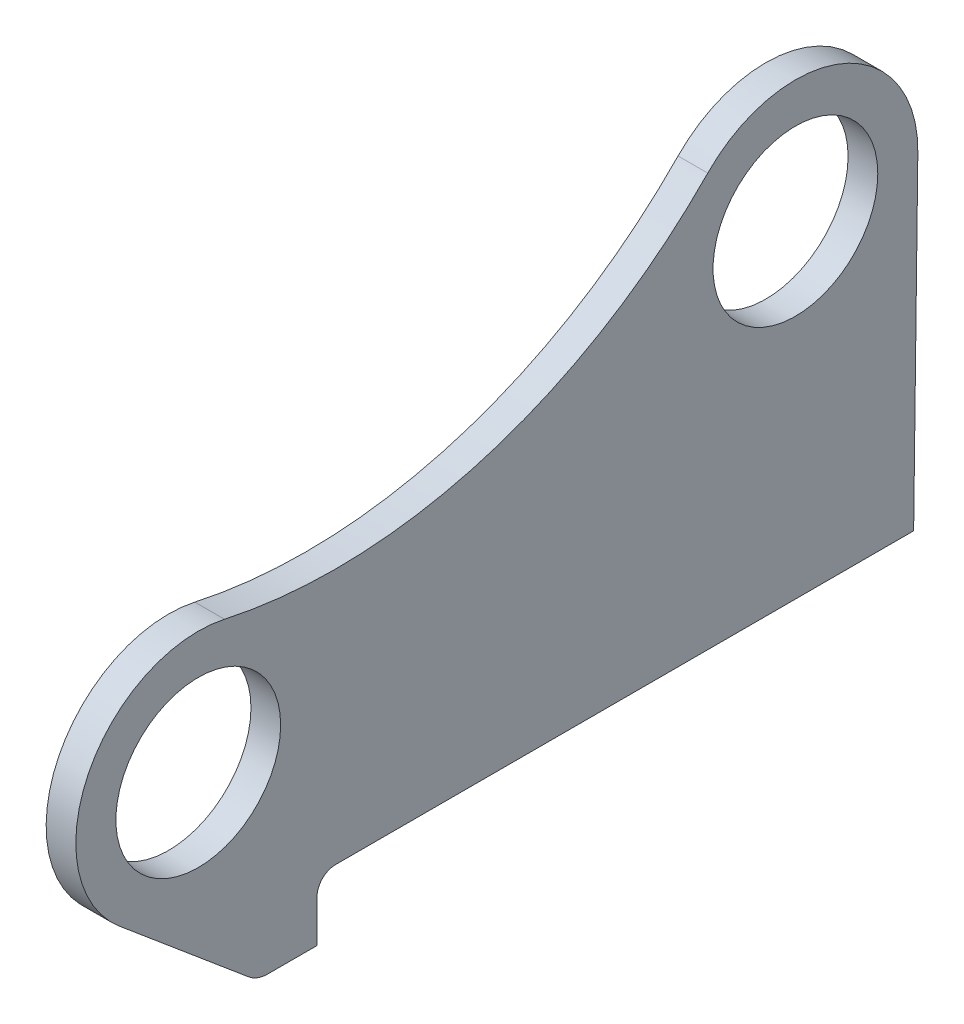
ISO-10303-21;
HEADER;
FILE_DESCRIPTION(('STEP AP214'),'2;1');
FILE_NAME('part.step','',(''),(''),'','','');
FILE_SCHEMA(('AUTOMOTIVE_DESIGN { 1 0 10303 214 1 1 1 1 }'));
ENDSEC;
DATA;
#1=APPLICATION_CONTEXT('core data for automotive mechanical design processes');
#2=APPLICATION_PROTOCOL_DEFINITION('international standard','automotive_design',2000,#1);
#3=PRODUCT_CONTEXT('',#1,'mechanical');
#4=PRODUCT('Part','Part','',(#3));
#5=PRODUCT_RELATED_PRODUCT_CATEGORY('part','',(#4));
#6=PRODUCT_DEFINITION_FORMATION('','',#4);
#7=PRODUCT_DEFINITION_CONTEXT('part definition',#1,'design');
#8=PRODUCT_DEFINITION('design','',#6,#7);
#9=PRODUCT_DEFINITION_SHAPE('','',#8);
#10=(LENGTH_UNIT() NAMED_UNIT(*) SI_UNIT(.MILLI.,.METRE.));
#11=(NAMED_UNIT(*) PLANE_ANGLE_UNIT() SI_UNIT($,.RADIAN.));
#12=(NAMED_UNIT(*) SI_UNIT($,.STERADIAN.) SOLID_ANGLE_UNIT());
#13=UNCERTAINTY_MEASURE_WITH_UNIT(LENGTH_MEASURE(1.E-05),#10,'distance_accuracy_value','');
#14=(GEOMETRIC_REPRESENTATION_CONTEXT(3) GLOBAL_UNCERTAINTY_ASSIGNED_CONTEXT((#13)) GLOBAL_UNIT_ASSIGNED_CONTEXT((#10,
#11,#12)) REPRESENTATION_CONTEXT('',''));
#15=CARTESIAN_POINT('',(0.,0.,0.));
#16=DIRECTION('',(0.,0.,1.));
#17=DIRECTION('',(1.,0.,0.));
#18=AXIS2_PLACEMENT_3D('',#15,#16,#17);
#19=CARTESIAN_POINT('',(-20.,522.453686390013,-12.6775747173587));
#20=DIRECTION('',(1.,0.,0.));
#21=DIRECTION('',(0.,0.,-1.));
#22=AXIS2_PLACEMENT_3D('',#19,#20,#21);
#23=CYLINDRICAL_SURFACE('',#22,350.);
#24=CARTESIAN_POINT('',(0.,522.453686390013,-12.6775747173587));
#25=DIRECTION('',(-1.,0.,0.));
#26=DIRECTION('',(0.,0.,-1.));
#27=AXIS2_PLACEMENT_3D('',#24,#25,#26);
#28=CIRCLE('',#27,350.);
#29=CARTESIAN_POINT('',(0.,278.110759488816,-263.269941068284));
#30=VERTEX_POINT('',#29);
#31=CARTESIAN_POINT('',(0.,180.583651161104,62.3216186955327));
#32=VERTEX_POINT('',#31);
#33=EDGE_CURVE('E152',#30,#32,#28,.T.);
#34=ORIENTED_EDGE('',*,*,#33,.F.);
#35=DIRECTION('',(1.,0.,0.));
#36=VECTOR('',#35,1.);
#37=CARTESIAN_POINT('',(-20.,278.110759488816,-263.269941068284));
#38=LINE('',#37,#36);
#39=CARTESIAN_POINT('',(-20.,278.110759488816,-263.269941068284));
#40=VERTEX_POINT('',#39);
#41=EDGE_CURVE('E11',#40,#30,#38,.T.);
#42=ORIENTED_EDGE('',*,*,#41,.F.);
#43=CARTESIAN_POINT('',(-20.,522.453686390013,-12.6775747173587));
#44=DIRECTION('',(-1.,0.,0.));
#45=DIRECTION('',(0.,0.,-1.));
#46=AXIS2_PLACEMENT_3D('',#43,#44,#45);
#47=CIRCLE('',#46,350.);
#48=CARTESIAN_POINT('',(-20.,180.583651161104,62.3216186955327));
#49=VERTEX_POINT('',#48);
#50=EDGE_CURVE('E179',#40,#49,#47,.T.);
#51=ORIENTED_EDGE('',*,*,#50,.T.);
#52=DIRECTION('',(1.,0.,0.));
#53=VECTOR('',#52,1.);
#54=CARTESIAN_POINT('',(-20.,180.583651161104,62.3216186955327));
#55=LINE('',#54,#53);
#56=EDGE_CURVE('E46',#49,#32,#55,.T.);
#57=ORIENTED_EDGE('',*,*,#56,.T.);
#58=EDGE_LOOP('',(#34,#42,#51,#57));
#59=FACE_BOUND('',#58,.T.);
#60=ADVANCED_FACE('F43',(#59),#23,.F.);
#61=CARTESIAN_POINT('',(-20.,220.515641004963,-322.338141708145));
#62=DIRECTION('',(1.,0.,0.));
#63=DIRECTION('',(0.,0.,-1.));
#64=AXIS2_PLACEMENT_3D('',#61,#62,#63);
#65=CYLINDRICAL_SURFACE('',#64,82.5000000000001);
#66=CARTESIAN_POINT('',(0.,220.515641004963,-322.338141708145));
#67=DIRECTION('',(1.,0.,0.));
#68=DIRECTION('',(0.,0.,-1.));
#69=AXIS2_PLACEMENT_3D('',#66,#67,#68);
#70=CIRCLE('',#69,82.5000000000001);
#71=CARTESIAN_POINT('',(0.,219.451346471347,-404.831276435501));
#72=VERTEX_POINT('',#71);
#73=EDGE_CURVE('E177',#72,#30,#70,.T.);
#74=ORIENTED_EDGE('',*,*,#73,.F.);
#75=DIRECTION('',(1.,0.,0.));
#76=VECTOR('',#75,1.);
#77=CARTESIAN_POINT('',(-20.,219.451346471347,-404.831276435501));
#78=LINE('',#77,#76);
#79=CARTESIAN_POINT('',(-20.,219.451346471347,-404.831276435501));
#80=VERTEX_POINT('',#79);
#81=EDGE_CURVE('E52',#80,#72,#78,.T.);
#82=ORIENTED_EDGE('',*,*,#81,.F.);
#83=CARTESIAN_POINT('',(-20.,220.515641004963,-322.338141708145));
#84=DIRECTION('',(1.,0.,0.));
#85=DIRECTION('',(0.,0.,-1.));
#86=AXIS2_PLACEMENT_3D('',#83,#84,#85);
#87=CIRCLE('',#86,82.5000000000001);
#88=EDGE_CURVE('E142',#80,#40,#87,.T.);
#89=ORIENTED_EDGE('',*,*,#88,.T.);
#90=ORIENTED_EDGE('',*,*,#41,.T.);
#91=EDGE_LOOP('',(#74,#82,#89,#90));
#92=FACE_BOUND('',#91,.T.);
#93=ADVANCED_FACE('F195',(#92),#65,.T.);
#94=CARTESIAN_POINT('',(-20.,0.,-402.));
#95=DIRECTION('',(0.,-0.0129005398014108,-0.999916784574013));
#96=DIRECTION('',(0.,0.999916784574013,-0.0129005398014108));
#97=AXIS2_PLACEMENT_3D('',#94,#95,#96);
#98=PLANE('',#97);
#99=DIRECTION('',(0.,0.999916784574012,-0.0129005398014108));
#100=VECTOR('',#99,1.);
#101=CARTESIAN_POINT('',(0.,0.,-402.));
#102=LINE('',#101,#100);
#103=CARTESIAN_POINT('',(0.,0.,-402.));
#104=VERTEX_POINT('',#103);
#105=EDGE_CURVE('E129',#104,#72,#102,.T.);
#106=ORIENTED_EDGE('',*,*,#105,.F.);
#107=DIRECTION('',(1.,0.,0.));
#108=VECTOR('',#107,1.);
#109=CARTESIAN_POINT('',(-20.,0.,-402.));
#110=LINE('',#109,#108);
#111=CARTESIAN_POINT('',(-20.,0.,-402.));
#112=VERTEX_POINT('',#111);
#113=EDGE_CURVE('E124',#112,#104,#110,.T.);
#114=ORIENTED_EDGE('',*,*,#113,.F.);
#115=DIRECTION('',(0.,0.999916784574012,-0.0129005398014108));
#116=VECTOR('',#115,1.);
#117=CARTESIAN_POINT('',(-20.,0.,-402.));
#118=LINE('',#117,#116);
#119=EDGE_CURVE('E127',#112,#80,#118,.T.);
#120=ORIENTED_EDGE('',*,*,#119,.T.);
#121=ORIENTED_EDGE('',*,*,#81,.T.);
#122=EDGE_LOOP('',(#106,#114,#120,#121));
#123=FACE_BOUND('',#122,.T.);
#124=ADVANCED_FACE('F126',(#123),#98,.T.);
#125=CARTESIAN_POINT('',(-20.,0.,-12.5));
#126=DIRECTION('',(0.,-1.,0.));
#127=DIRECTION('',(0.,0.,-1.));
#128=AXIS2_PLACEMENT_3D('',#125,#126,#127);
#129=PLANE('',#128);
#130=DIRECTION('',(0.,0.,-1.));
#131=VECTOR('',#130,1.);
#132=CARTESIAN_POINT('',(0.,0.,-12.5));
#133=LINE('',#132,#131);
#134=CARTESIAN_POINT('',(0.,0.,-12.5));
#135=VERTEX_POINT('',#134);
#136=EDGE_CURVE('E174',#135,#104,#133,.T.);
#137=ORIENTED_EDGE('',*,*,#136,.F.);
#138=DIRECTION('',(1.,0.,0.));
#139=VECTOR('',#138,1.);
#140=CARTESIAN_POINT('',(-20.,0.,-12.5));
#141=LINE('',#140,#139);
#142=CARTESIAN_POINT('',(-20.,0.,-12.5));
#143=VERTEX_POINT('',#142);
#144=EDGE_CURVE('E134',#143,#135,#141,.T.);
#145=ORIENTED_EDGE('',*,*,#144,.F.);
#146=DIRECTION('',(0.,0.,-1.));
#147=VECTOR('',#146,1.);
#148=CARTESIAN_POINT('',(-20.,0.,-12.5));
#149=LINE('',#148,#147);
#150=EDGE_CURVE('E140',#143,#112,#149,.T.);
#151=ORIENTED_EDGE('',*,*,#150,.T.);
#152=ORIENTED_EDGE('',*,*,#113,.T.);
#153=EDGE_LOOP('',(#137,#145,#151,#152));
#154=FACE_BOUND('',#153,.T.);
#155=ADVANCED_FACE('F144',(#154),#129,.T.);
#156=CARTESIAN_POINT('',(-20.,-12.5,-12.5));
#157=DIRECTION('',(1.,0.,0.));
#158=DIRECTION('',(0.,0.,-1.));
#159=AXIS2_PLACEMENT_3D('',#156,#157,#158);
#160=CYLINDRICAL_SURFACE('',#159,12.5);
#161=CARTESIAN_POINT('',(0.,-12.5,-12.5));
#162=DIRECTION('',(-1.,0.,0.));
#163=DIRECTION('',(0.,0.,1.));
#164=AXIS2_PLACEMENT_3D('',#161,#162,#163);
#165=CIRCLE('',#164,12.5);
#166=CARTESIAN_POINT('',(0.,-12.5,0.));
#167=VERTEX_POINT('',#166);
#168=EDGE_CURVE('E171',#167,#135,#165,.T.);
#169=ORIENTED_EDGE('',*,*,#168,.F.);
#170=DIRECTION('',(1.,0.,0.));
#171=VECTOR('',#170,1.);
#172=CARTESIAN_POINT('',(-20.,-12.5,0.));
#173=LINE('',#172,#171);
#174=CARTESIAN_POINT('',(-20.,-12.5,0.));
#175=VERTEX_POINT('',#174);
#176=EDGE_CURVE('E183',#175,#167,#173,.T.);
#177=ORIENTED_EDGE('',*,*,#176,.F.);
#178=CARTESIAN_POINT('',(-20.,-12.5,-12.5));
#179=DIRECTION('',(-1.,0.,0.));
#180=DIRECTION('',(0.,0.,1.));
#181=AXIS2_PLACEMENT_3D('',#178,#179,#180);
#182=CIRCLE('',#181,12.5);
#183=EDGE_CURVE('E145',#175,#143,#182,.T.);
#184=ORIENTED_EDGE('',*,*,#183,.T.);
#185=ORIENTED_EDGE('',*,*,#144,.T.);
#186=EDGE_LOOP('',(#169,#177,#184,#185));
#187=FACE_BOUND('',#186,.T.);
#188=ADVANCED_FACE('F208',(#187),#160,.F.);
#189=CARTESIAN_POINT('',(-20.,-41.,0.));
#190=DIRECTION('',(0.,0.,-1.));
#191=DIRECTION('',(-1.,0.,0.));
#192=AXIS2_PLACEMENT_3D('',#189,#190,#191);
#193=PLANE('',#192);
#194=DIRECTION('',(0.,1.,0.));
#195=VECTOR('',#194,1.);
#196=CARTESIAN_POINT('',(0.,-41.,0.));
#197=LINE('',#196,#195);
#198=CARTESIAN_POINT('',(0.,-41.,0.));
#199=VERTEX_POINT('',#198);
#200=EDGE_CURVE('E168',#199,#167,#197,.T.);
#201=ORIENTED_EDGE('',*,*,#200,.F.);
#202=DIRECTION('',(1.,0.,0.));
#203=VECTOR('',#202,1.);
#204=CARTESIAN_POINT('',(-20.,-41.,0.));
#205=LINE('',#204,#203);
#206=CARTESIAN_POINT('',(-20.,-41.,0.));
#207=VERTEX_POINT('',#206);
#208=EDGE_CURVE('E185',#207,#199,#205,.T.);
#209=ORIENTED_EDGE('',*,*,#208,.F.);
#210=DIRECTION('',(0.,1.,0.));
#211=VECTOR('',#210,1.);
#212=CARTESIAN_POINT('',(-20.,-41.,0.));
#213=LINE('',#212,#211);
#214=EDGE_CURVE('E147',#207,#175,#213,.T.);
#215=ORIENTED_EDGE('',*,*,#214,.T.);
#216=ORIENTED_EDGE('',*,*,#176,.T.);
#217=EDGE_LOOP('',(#201,#209,#215,#216));
#218=FACE_BOUND('',#217,.T.);
#219=ADVANCED_FACE('F211',(#218),#193,.T.);
#220=CARTESIAN_POINT('',(-20.,-41.,0.));
#221=DIRECTION('',(0.,-1.,0.));
#222=DIRECTION('',(0.,0.,-1.));
#223=AXIS2_PLACEMENT_3D('',#220,#221,#222);
#224=PLANE('',#223);
#225=DIRECTION('',(0.,0.,-1.));
#226=VECTOR('',#225,1.);
#227=CARTESIAN_POINT('',(0.,-41.,0.));
#228=LINE('',#227,#226);
#229=CARTESIAN_POINT('',(0.,-41.,33.1096120214944));
#230=VERTEX_POINT('',#229);
#231=EDGE_CURVE('E165',#230,#199,#228,.T.);
#232=ORIENTED_EDGE('',*,*,#231,.F.);
#233=DIRECTION('',(1.,0.,0.));
#234=VECTOR('',#233,1.);
#235=CARTESIAN_POINT('',(-20.,-41.,33.1096120214944));
#236=LINE('',#235,#234);
#237=CARTESIAN_POINT('',(-20.,-41.,33.1096120214944));
#238=VERTEX_POINT('',#237);
#239=EDGE_CURVE('E187',#238,#230,#236,.T.);
#240=ORIENTED_EDGE('',*,*,#239,.F.);
#241=DIRECTION('',(0.,0.,-1.));
#242=VECTOR('',#241,1.);
#243=CARTESIAN_POINT('',(-20.,-41.,0.));
#244=LINE('',#243,#242);
#245=EDGE_CURVE('E271',#238,#207,#244,.T.);
#246=ORIENTED_EDGE('',*,*,#245,.T.);
#247=ORIENTED_EDGE('',*,*,#208,.T.);
#248=EDGE_LOOP('',(#232,#240,#246,#247));
#249=FACE_BOUND('',#248,.T.);
#250=ADVANCED_FACE('F215',(#249),#224,.T.);
#251=CARTESIAN_POINT('',(-20.,-21.,33.1096120214943));
#252=DIRECTION('',(1.,0.,0.));
#253=DIRECTION('',(0.,0.,-1.));
#254=AXIS2_PLACEMENT_3D('',#251,#252,#253);
#255=CYLINDRICAL_SURFACE('',#254,20.);
#256=CARTESIAN_POINT('',(0.,-21.,33.1096120214943));
#257=DIRECTION('',(1.,0.,0.));
#258=DIRECTION('',(0.,0.,-1.));
#259=AXIS2_PLACEMENT_3D('',#256,#257,#258);
#260=CIRCLE('',#259,20.);
#261=CARTESIAN_POINT('',(0.,-36.3151421434658,45.972209781101));
#262=VERTEX_POINT('',#261);
#263=EDGE_CURVE('E162',#262,#230,#260,.T.);
#264=ORIENTED_EDGE('',*,*,#263,.F.);
#265=DIRECTION('',(1.,0.,0.));
#266=VECTOR('',#265,1.);
#267=CARTESIAN_POINT('',(-20.,-36.3151421434658,45.972209781101));
#268=LINE('',#267,#266);
#269=CARTESIAN_POINT('',(-20.,-36.3151421434658,45.972209781101));
#270=VERTEX_POINT('',#269);
#271=EDGE_CURVE('E189',#270,#262,#268,.T.);
#272=ORIENTED_EDGE('',*,*,#271,.F.);
#273=CARTESIAN_POINT('',(-20.,-21.,33.1096120214943));
#274=DIRECTION('',(1.,0.,0.));
#275=DIRECTION('',(0.,0.,-1.));
#276=AXIS2_PLACEMENT_3D('',#273,#274,#275);
#277=CIRCLE('',#276,20.);
#278=EDGE_CURVE('E268',#270,#238,#277,.T.);
#279=ORIENTED_EDGE('',*,*,#278,.T.);
#280=ORIENTED_EDGE('',*,*,#239,.T.);
#281=EDGE_LOOP('',(#264,#272,#279,#280));
#282=FACE_BOUND('',#281,.T.);
#283=ADVANCED_FACE('F219',(#282),#255,.T.);
#284=CARTESIAN_POINT('',(-20.,36.8250386582074,133.058215758378));
#285=DIRECTION('',(0.,-0.765757107173288,0.643129887980334));
#286=DIRECTION('',(0.,-0.643129887980334,-0.765757107173288));
#287=AXIS2_PLACEMENT_3D('',#284,#285,#286);
#288=PLANE('',#287);
#289=DIRECTION('',(0.,-0.643129887980334,-0.765757107173288));
#290=VECTOR('',#289,1.);
#291=CARTESIAN_POINT('',(0.,36.8250386582074,133.058215758378));
#292=LINE('',#291,#290);
#293=CARTESIAN_POINT('',(0.,36.8250386582073,133.058215758378));
#294=VERTEX_POINT('',#293);
#295=EDGE_CURVE('E159',#294,#262,#292,.T.);
#296=ORIENTED_EDGE('',*,*,#295,.F.);
#297=DIRECTION('',(1.,0.,0.));
#298=VECTOR('',#297,1.);
#299=CARTESIAN_POINT('',(-20.,36.8250386582073,133.058215758378));
#300=LINE('',#299,#298);
#301=CARTESIAN_POINT('',(-20.,36.8250386582073,133.058215758378));
#302=VERTEX_POINT('',#301);
#303=EDGE_CURVE('E190',#302,#294,#300,.T.);
#304=ORIENTED_EDGE('',*,*,#303,.F.);
#305=DIRECTION('',(0.,-0.643129887980334,-0.765757107173288));
#306=VECTOR('',#305,1.);
#307=CARTESIAN_POINT('',(-20.,36.8250386582074,133.058215758378));
#308=LINE('',#307,#306);
#309=EDGE_CURVE('E265',#302,#270,#308,.T.);
#310=ORIENTED_EDGE('',*,*,#309,.T.);
#311=ORIENTED_EDGE('',*,*,#271,.T.);
#312=EDGE_LOOP('',(#296,#304,#310,#311));
#313=FACE_BOUND('',#312,.T.);
#314=ADVANCED_FACE('F223',(#313),#288,.T.);
#315=CARTESIAN_POINT('',(-20.,100.000000000004,80.));
#316=DIRECTION('',(1.,0.,0.));
#317=DIRECTION('',(0.,0.,-1.));
#318=AXIS2_PLACEMENT_3D('',#315,#316,#317);
#319=CYLINDRICAL_SURFACE('',#318,82.5);
#320=CARTESIAN_POINT('',(0.,100.000000000004,80.));
#321=DIRECTION('',(1.,0.,0.));
#322=DIRECTION('',(0.,0.,-1.));
#323=AXIS2_PLACEMENT_3D('',#320,#321,#322);
#324=CIRCLE('',#323,82.5);
#325=EDGE_CURVE('E155',#32,#294,#324,.T.);
#326=ORIENTED_EDGE('',*,*,#325,.F.);
#327=ORIENTED_EDGE('',*,*,#56,.F.);
#328=CARTESIAN_POINT('',(-20.,100.000000000004,80.));
#329=DIRECTION('',(1.,0.,0.));
#330=DIRECTION('',(0.,0.,-1.));
#331=AXIS2_PLACEMENT_3D('',#328,#329,#330);
#332=CIRCLE('',#331,82.5);
#333=EDGE_CURVE('E263',#49,#302,#332,.T.);
#334=ORIENTED_EDGE('',*,*,#333,.T.);
#335=ORIENTED_EDGE('',*,*,#303,.T.);
#336=EDGE_LOOP('',(#326,#327,#334,#335));
#337=FACE_BOUND('',#336,.T.);
#338=ADVANCED_FACE('F192',(#337),#319,.T.);
#339=CARTESIAN_POINT('',(-20.,522.453686390013,-12.6775747173587));
#340=DIRECTION('',(1.,0.,0.));
#341=DIRECTION('',(0.,0.,-1.));
#342=AXIS2_PLACEMENT_3D('',#339,#340,#341);
#343=PLANE('',#342);
#344=CARTESIAN_POINT('',(-20.,220.515641004963,-322.338141708145));
#345=DIRECTION('',(1.,0.,0.));
#346=DIRECTION('',(0.,0.,-1.));
#347=AXIS2_PLACEMENT_3D('',#344,#345,#346);
#348=CIRCLE('',#347,55.5);
#349=CARTESIAN_POINT('',(-20.,220.515641004963,-377.838141708145));
#350=VERTEX_POINT('',#349);
#351=EDGE_CURVE('E250',#350,#350,#348,.T.);
#352=ORIENTED_EDGE('',*,*,#351,.T.);
#353=EDGE_LOOP('',(#352));
#354=FACE_BOUND('',#353,.T.);
#355=CARTESIAN_POINT('',(-20.,100.000000000004,80.));
#356=DIRECTION('',(1.,0.,0.));
#357=DIRECTION('',(0.,0.,-1.));
#358=AXIS2_PLACEMENT_3D('',#355,#356,#357);
#359=CIRCLE('',#358,55.5);
#360=CARTESIAN_POINT('',(-20.,100.000000000004,24.5));
#361=VERTEX_POINT('',#360);
#362=EDGE_CURVE('E156',#361,#361,#359,.T.);
#363=ORIENTED_EDGE('',*,*,#362,.T.);
#364=EDGE_LOOP('',(#363));
#365=FACE_BOUND('',#364,.T.);
#366=ORIENTED_EDGE('',*,*,#50,.F.);
#367=ORIENTED_EDGE('',*,*,#88,.F.);
#368=ORIENTED_EDGE('',*,*,#119,.F.);
#369=ORIENTED_EDGE('',*,*,#150,.F.);
#370=ORIENTED_EDGE('',*,*,#183,.F.);
#371=ORIENTED_EDGE('',*,*,#214,.F.);
#372=ORIENTED_EDGE('',*,*,#245,.F.);
#373=ORIENTED_EDGE('',*,*,#278,.F.);
#374=ORIENTED_EDGE('',*,*,#309,.F.);
#375=ORIENTED_EDGE('',*,*,#333,.F.);
#376=EDGE_LOOP('',(#366,#367,#368,#369,#370,#371,#372,#373,#374,#375));
#377=FACE_BOUND('',#376,.T.);
#378=ADVANCED_FACE('F138',(#354,#365,#377),#343,.F.);
#379=CARTESIAN_POINT('',(0.,522.453686390013,-12.6775747173587));
#380=DIRECTION('',(1.,0.,0.));
#381=DIRECTION('',(0.,0.,-1.));
#382=AXIS2_PLACEMENT_3D('',#379,#380,#381);
#383=PLANE('',#382);
#384=CARTESIAN_POINT('',(0.,220.515641004963,-322.338141708145));
#385=DIRECTION('',(1.,0.,0.));
#386=DIRECTION('',(0.,0.,-1.));
#387=AXIS2_PLACEMENT_3D('',#384,#385,#386);
#388=CIRCLE('',#387,55.5);
#389=CARTESIAN_POINT('',(0.,220.515641004963,-377.838141708145));
#390=VERTEX_POINT('',#389);
#391=EDGE_CURVE('E253',#390,#390,#388,.T.);
#392=ORIENTED_EDGE('',*,*,#391,.F.);
#393=EDGE_LOOP('',(#392));
#394=FACE_BOUND('',#393,.T.);
#395=CARTESIAN_POINT('',(0.,100.000000000004,80.));
#396=DIRECTION('',(1.,0.,0.));
#397=DIRECTION('',(0.,0.,-1.));
#398=AXIS2_PLACEMENT_3D('',#395,#396,#397);
#399=CIRCLE('',#398,55.5);
#400=CARTESIAN_POINT('',(0.,100.000000000004,24.5));
#401=VERTEX_POINT('',#400);
#402=EDGE_CURVE('E255',#401,#401,#399,.T.);
#403=ORIENTED_EDGE('',*,*,#402,.F.);
#404=EDGE_LOOP('',(#403));
#405=FACE_BOUND('',#404,.T.);
#406=ORIENTED_EDGE('',*,*,#33,.T.);
#407=ORIENTED_EDGE('',*,*,#325,.T.);
#408=ORIENTED_EDGE('',*,*,#295,.T.);
#409=ORIENTED_EDGE('',*,*,#263,.T.);
#410=ORIENTED_EDGE('',*,*,#231,.T.);
#411=ORIENTED_EDGE('',*,*,#200,.T.);
#412=ORIENTED_EDGE('',*,*,#168,.T.);
#413=ORIENTED_EDGE('',*,*,#136,.T.);
#414=ORIENTED_EDGE('',*,*,#105,.T.);
#415=ORIENTED_EDGE('',*,*,#73,.T.);
#416=EDGE_LOOP('',(#406,#407,#408,#409,#410,#411,#412,#413,#414,#415));
#417=FACE_BOUND('',#416,.T.);
#418=ADVANCED_FACE('F194',(#394,#405,#417),#383,.T.);
#419=CARTESIAN_POINT('',(-20.,100.000000000004,80.));
#420=DIRECTION('',(1.,0.,0.));
#421=DIRECTION('',(0.,0.,-1.));
#422=AXIS2_PLACEMENT_3D('',#419,#420,#421);
#423=CYLINDRICAL_SURFACE('',#422,55.5);
#424=ORIENTED_EDGE('',*,*,#362,.F.);
#425=EDGE_LOOP('',(#424));
#426=FACE_BOUND('',#425,.T.);
#427=ORIENTED_EDGE('',*,*,#402,.T.);
#428=EDGE_LOOP('',(#427));
#429=FACE_BOUND('',#428,.T.);
#430=ADVANCED_FACE('F235',(#426,#429),#423,.F.);
#431=CARTESIAN_POINT('',(-20.,220.515641004963,-322.338141708145));
#432=DIRECTION('',(1.,0.,0.));
#433=DIRECTION('',(0.,0.,-1.));
#434=AXIS2_PLACEMENT_3D('',#431,#432,#433);
#435=CYLINDRICAL_SURFACE('',#434,55.5);
#436=ORIENTED_EDGE('',*,*,#351,.F.);
#437=EDGE_LOOP('',(#436));
#438=FACE_BOUND('',#437,.T.);
#439=ORIENTED_EDGE('',*,*,#391,.T.);
#440=EDGE_LOOP('',(#439));
#441=FACE_BOUND('',#440,.T.);
#442=ADVANCED_FACE('F242',(#438,#441),#435,.F.);
#443=CLOSED_SHELL('',(#60,#93,#124,#155,#188,#219,#250,#283,#314,#338,#378,#418,#430,#442));
#444=MANIFOLD_SOLID_BREP('B2',#443);
#445=ADVANCED_BREP_SHAPE_REPRESENTATION('',(#18,#444),#14);
#446=SHAPE_DEFINITION_REPRESENTATION(#9,#445);
ENDSEC;
END-ISO-10303-21;
